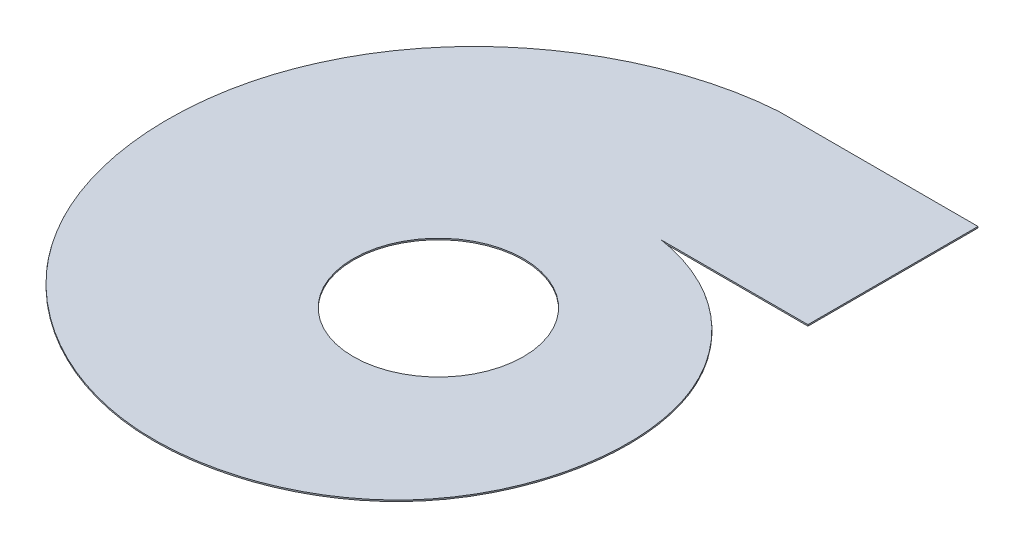
ISO-10303-21;
HEADER;
FILE_DESCRIPTION(('STEP AP214'),'2;1');
FILE_NAME('part.step','',(''),(''),'','','');
FILE_SCHEMA(('AUTOMOTIVE_DESIGN { 1 0 10303 214 1 1 1 1 }'));
ENDSEC;
DATA;
#1=APPLICATION_CONTEXT('core data for automotive mechanical design processes');
#2=APPLICATION_PROTOCOL_DEFINITION('international standard','automotive_design',2000,#1);
#3=PRODUCT_CONTEXT('',#1,'mechanical');
#4=PRODUCT('Part','Part','',(#3));
#5=PRODUCT_RELATED_PRODUCT_CATEGORY('part','',(#4));
#6=PRODUCT_DEFINITION_FORMATION('','',#4);
#7=PRODUCT_DEFINITION_CONTEXT('part definition',#1,'design');
#8=PRODUCT_DEFINITION('design','',#6,#7);
#9=PRODUCT_DEFINITION_SHAPE('','',#8);
#10=(LENGTH_UNIT() NAMED_UNIT(*) SI_UNIT(.MILLI.,.METRE.));
#11=(NAMED_UNIT(*) PLANE_ANGLE_UNIT() SI_UNIT($,.RADIAN.));
#12=(NAMED_UNIT(*) SI_UNIT($,.STERADIAN.) SOLID_ANGLE_UNIT());
#13=UNCERTAINTY_MEASURE_WITH_UNIT(LENGTH_MEASURE(1.E-05),#10,'distance_accuracy_value','');
#14=(GEOMETRIC_REPRESENTATION_CONTEXT(3) GLOBAL_UNCERTAINTY_ASSIGNED_CONTEXT((#13)) GLOBAL_UNIT_ASSIGNED_CONTEXT((#10,
#11,#12)) REPRESENTATION_CONTEXT('',''));
#15=CARTESIAN_POINT('',(0.,0.,0.));
#16=DIRECTION('',(0.,0.,1.));
#17=DIRECTION('',(1.,0.,0.));
#18=AXIS2_PLACEMENT_3D('',#15,#16,#17);
#19=CARTESIAN_POINT('',(-202.088029277198,0.,340.089037520894));
#20=DIRECTION('',(0.,-1.,0.));
#21=DIRECTION('',(0.,0.,-1.));
#22=AXIS2_PLACEMENT_3D('',#19,#20,#21);
#23=PLANE('',#22);
#24=CARTESIAN_POINT('',(0.,0.,0.));
#25=DIRECTION('',(0.,1.,0.));
#26=DIRECTION('',(0.,0.,1.));
#27=AXIS2_PLACEMENT_3D('',#24,#25,#26);
#28=CIRCLE('',#27,125.);
#29=CARTESIAN_POINT('',(0.,0.,125.));
#30=VERTEX_POINT('',#29);
#31=EDGE_CURVE('E185',#30,#30,#28,.T.);
#32=ORIENTED_EDGE('',*,*,#31,.F.);
#33=EDGE_LOOP('',(#32));
#34=FACE_BOUND('',#33,.T.);
#35=CARTESIAN_POINT('',(-1.51614831800373E-12,0.,-500.));
#36=CARTESIAN_POINT('',(-121.735694782618,0.,-491.432273979318));
#37=CARTESIAN_POINT('',(-313.70035987812,0.,-396.44166070075));
#38=CARTESIAN_POINT('',(-452.526897534728,0.,-136.273127559046));
#39=CARTESIAN_POINT('',(-438.495522047138,0.,84.5434590160957));
#40=CARTESIAN_POINT('',(-316.990167099942,0.,288.560325686227));
#41=CARTESIAN_POINT('',(-69.9789110870107,0.,425.752164190326));
#42=CARTESIAN_POINT('',(285.053092388066,0.,296.782675328895));
#43=CARTESIAN_POINT('',(348.131054402755,0.,-49.5077087625764));
#44=CARTESIAN_POINT('',(180.649502040765,0.,-235.122306433307));
#45=CARTESIAN_POINT('',(56.0182707534848,0.,-259.081421156659));
#46=CARTESIAN_POINT('',(0.,0.,-250.));
#47=B_SPLINE_CURVE_WITH_KNOTS('',3,(#35,#36,#37,#38,#39,#40,#41,#42,#43,#44,#45,#46),
.UNSPECIFIED.,.F.,.F.,(4,1,1,1,1,1,1,1,1,4),(0.,0.158819890851184,0.25244839977915,
0.369226367804826,0.42541946423916,0.556944650266808,0.698898778526058,0.846399015982612,
0.926374081741202,1.),.UNSPECIFIED.);
#48=CARTESIAN_POINT('',(-59.0712145920364,0.,376.585920873753));
#49=VERTEX_POINT('',#48);
#50=CARTESIAN_POINT('',(77.7700123232973,0.,-250.000000000145));
#51=VERTEX_POINT('',#50);
#52=EDGE_CURVE('E59',#49,#51,#47,.T.);
#53=ORIENTED_EDGE('',*,*,#52,.T.);
#54=DIRECTION('',(1.,0.,0.));
#55=VECTOR('',#54,1.);
#56=CARTESIAN_POINT('',(0.,0.,-250.));
#57=LINE('',#56,#55);
#58=CARTESIAN_POINT('',(293.259068653268,0.,-250.));
#59=VERTEX_POINT('',#58);
#60=EDGE_CURVE('E187',#51,#59,#57,.T.);
#61=ORIENTED_EDGE('',*,*,#60,.T.);
#62=DIRECTION('',(0.,0.,1.));
#63=VECTOR('',#62,1.);
#64=CARTESIAN_POINT('',(293.259068653268,0.,-500.));
#65=LINE('',#64,#63);
#66=CARTESIAN_POINT('',(293.259068653268,0.,-500.));
#67=VERTEX_POINT('',#66);
#68=EDGE_CURVE('E117',#67,#59,#65,.T.);
#69=ORIENTED_EDGE('',*,*,#68,.F.);
#70=DIRECTION('',(1.,0.,0.));
#71=VECTOR('',#70,1.);
#72=CARTESIAN_POINT('',(-1.51614831800373E-12,0.,-500.));
#73=LINE('',#72,#71);
#74=CARTESIAN_POINT('',(-1.51614831800373E-12,0.,-500.));
#75=VERTEX_POINT('',#74);
#76=EDGE_CURVE('E105',#75,#67,#73,.T.);
#77=ORIENTED_EDGE('',*,*,#76,.F.);
#78=CARTESIAN_POINT('',(-71.8416246862968,0.,375.710516909708));
#79=VERTEX_POINT('',#78);
#80=EDGE_CURVE('E13',#75,#79,#47,.T.);
#81=ORIENTED_EDGE('',*,*,#80,.T.);
#82=CARTESIAN_POINT('',(0.,0.,-250.));
#83=CARTESIAN_POINT('',(8.18123086876726,0.,-251.302083333026));
#84=CARTESIAN_POINT('',(16.4904858589972,0.,-252.202239115932));
#85=CARTESIAN_POINT('',(33.2838432146078,0.,-253.165004897292));
#86=CARTESIAN_POINT('',(41.767918014095,0.,-253.227597369565));
#87=CARTESIAN_POINT('',(58.8255292754711,0.,-252.489812838351));
#88=CARTESIAN_POINT('',(67.3990361988134,0.,-251.68942117223));
#89=CARTESIAN_POINT('',(84.5468495515692,0.,-249.209035812598));
#90=CARTESIAN_POINT('',(93.1211247685697,0.,-247.529030536377));
#91=CARTESIAN_POINT('',(110.179448675384,0.,-243.281971110244));
#92=CARTESIAN_POINT('',(118.66346480226,0.,-240.714908643898));
#93=CARTESIAN_POINT('',(135.448838643004,0.,-234.695772918887));
#94=CARTESIAN_POINT('',(143.750162787134,0.,-231.243694761559));
#95=CARTESIAN_POINT('',(160.077308395461,0.,-223.466249466396));
#96=CARTESIAN_POINT('',(168.103095643203,0.,-219.14088096369));
#97=CARTESIAN_POINT('',(183.786929166319,0.,-209.638354885954));
#98=CARTESIAN_POINT('',(191.444940950985,0.,-204.461199557863));
#99=CARTESIAN_POINT('',(206.302623466448,0.,-193.28636485957));
#100=CARTESIAN_POINT('',(213.50225981272,0.,-187.288691385962));
#101=CARTESIAN_POINT('',(227.355264370716,0.,-174.513728488617));
#102=CARTESIAN_POINT('',(234.008598689343,0.,-167.736448608729));
#103=CARTESIAN_POINT('',(246.684770923066,0.,-153.452592355728));
#104=CARTESIAN_POINT('',(252.707575824426,0.,-145.946029131675));
#105=CARTESIAN_POINT('',(264.043165004688,0.,-130.262996352308));
#106=CARTESIAN_POINT('',(269.355917530424,0.,-122.086543467484));
#107=CARTESIAN_POINT('',(279.197554898152,0.,-105.131744499288));
#108=CARTESIAN_POINT('',(283.726409621811,0.,-96.3534184851331));
#109=CARTESIAN_POINT('',(291.933011092096,0.,-78.2709576757544));
#110=CARTESIAN_POINT('',(295.610729718482,0.,-68.9668461837094));
#111=CARTESIAN_POINT('',(302.055300527236,0.,-49.9163187948688));
#112=CARTESIAN_POINT('',(304.822126933795,0.,-40.1699292330862));
#113=CARTESIAN_POINT('',(309.393446559202,0.,-20.3250245640646));
#114=CARTESIAN_POINT('',(311.19791666681,0.,-10.2265385853717));
#115=CARTESIAN_POINT('',(313.80208333319,0.,10.2265385853717));
#116=CARTESIAN_POINT('',(314.601759745985,0.,20.5810981281708));
#117=CARTESIAN_POINT('',(315.163575101264,0.,41.4453734866293));
#118=CARTESIAN_POINT('',(314.925697135991,0.,51.955055437251));
#119=CARTESIAN_POINT('',(313.389873122328,0.,73.0246821043311));
#120=CARTESIAN_POINT('',(312.091913646437,0.,83.5845910737915));
#121=CARTESIAN_POINT('',(308.424085304918,0.,104.646879333399));
#122=CARTESIAN_POINT('',(306.054206695925,0.,115.149221353839));
#123=CARTESIAN_POINT('',(300.241736514608,0.,135.986781135752));
#124=CARTESIAN_POINT('',(296.799139049597,0.,146.321960485977));
#125=CARTESIAN_POINT('',(288.851700556733,0.,166.714935062538));
#126=CARTESIAN_POINT('',(284.346857615167,0.,176.772691136304));
#127=CARTESIAN_POINT('',(274.296788150606,0.,196.501059173741));
#128=CARTESIAN_POINT('',(268.751563778678,0.,206.171631657383));
#129=CARTESIAN_POINT('',(256.653978741307,0.,225.017553672595));
#130=CARTESIAN_POINT('',(250.101624338251,0.,234.192863818506));
#131=CARTESIAN_POINT('',(236.034287727501,0.,251.943048247245));
#132=CARTESIAN_POINT('',(228.519315892065,0.,260.517883668511));
#133=CARTESIAN_POINT('',(212.58226450297,0.,276.965947185267));
#134=CARTESIAN_POINT('',(204.160199387239,0.,284.839137373345));
#135=CARTESIAN_POINT('',(186.475120704669,0.,299.787933776882));
#136=CARTESIAN_POINT('',(177.212125551479,0.,306.863503462129));
#137=CARTESIAN_POINT('',(157.921492035754,0.,320.12739541053));
#138=CARTESIAN_POINT('',(147.893875927803,0.,326.315682934834));
#139=CARTESIAN_POINT('',(127.159841084605,0.,337.722731057653));
#140=CARTESIAN_POINT('',(116.453448267127,0.,342.941459114445));
#141=CARTESIAN_POINT('',(94.4565125505682,0.,352.335503565987));
#142=CARTESIAN_POINT('',(83.1659990126438,0.,356.510790002129));
#143=CARTESIAN_POINT('',(60.1034562179506,0.,363.753400293993));
#144=CARTESIAN_POINT('',(48.3314595051577,0.,366.820697137299));
#145=CARTESIAN_POINT('',(24.4156368331883,0.,371.792967189722));
#146=CARTESIAN_POINT('',(12.271846302555,0.,373.697916666581));
#147=CARTESIAN_POINT('',(-12.2718463025549,0.,376.302083333419));
#148=CARTESIAN_POINT('',(-24.6717103972528,0.,377.001280376191));
#149=CARTESIAN_POINT('',(-49.6069037587423,0.,377.162145305084));
#150=CARTESIAN_POINT('',(-62.1421928603835,0.,376.623796902581));
#151=CARTESIAN_POINT('',(-87.2238349332148,0.,374.289933406142));
#152=CARTESIAN_POINT('',(-99.7701459485291,0.,372.49440611977));
#153=CARTESIAN_POINT('',(-124.746909115469,0.,367.63913479811));
#154=CARTESIAN_POINT('',(-137.177317939081,0.,364.579382854976));
#155=CARTESIAN_POINT('',(-161.794113596146,0.,357.201501919467));
#156=CARTESIAN_POINT('',(-173.980456169745,0.,352.883369455503));
#157=CARTESIAN_POINT('',(-197.981031482019,0.,343.007628194371));
#158=CARTESIAN_POINT('',(-209.795219485259,0.,337.450020469828));
#159=CARTESIAN_POINT('',(-232.924809952237,0.,325.127326833763));
#160=CARTESIAN_POINT('',(-244.240167672522,0.,318.362246594301));
#161=CARTESIAN_POINT('',(-266.248178177912,0.,303.669602596026));
#162=CARTESIAN_POINT('',(-276.940786686513,0.,295.742049119143));
#163=CARTESIAN_POINT('',(-297.583473027557,0.,278.782210594927));
#164=CARTESIAN_POINT('',(-307.533507523385,0.,269.749940397866));
#165=CARTESIAN_POINT('',(-326.576630000735,0.,250.650800517624));
#166=CARTESIAN_POINT('',(-335.66967605612,0.,240.583950165703));
#167=CARTESIAN_POINT('',(-352.891096631925,0.,219.497649053655));
#168=CARTESIAN_POINT('',(-361.019431100395,0.,208.478221971));
#169=CARTESIAN_POINT('',(-376.211625815808,0.,185.579987719483));
#170=CARTESIAN_POINT('',(-383.27544833862,0.,173.701208388017));
#171=CARTESIAN_POINT('',(-396.247907217778,0.,149.187937670028));
#172=CARTESIAN_POINT('',(-402.156508607812,0.,136.553478048962));
#173=CARTESIAN_POINT('',(-412.737996039147,0.,110.642067425541));
#174=CARTESIAN_POINT('',(-417.410850285412,0.,97.3651518416145));
#175=CARTESIAN_POINT('',(-425.451500061114,0.,70.2905936409961));
#176=CARTESIAN_POINT('',(-428.819267340828,0.,56.4929897772418));
#177=CARTESIAN_POINT('',(-434.192487820218,0.,28.506249102299));
#178=CARTESIAN_POINT('',(-436.197916666667,0.,14.3171540197475));
#179=CARTESIAN_POINT('',(-438.802083333333,0.,-14.3171540197474));
#180=CARTESIAN_POINT('',(-439.400801007106,0.,-28.7623226663634));
#181=CARTESIAN_POINT('',(-439.160715508193,0.,-57.7684340308264));
#182=CARTESIAN_POINT('',(-438.321896668493,0.,-72.3293302831626));
#183=CARTESIAN_POINT('',(-435.189993690634,0.,-101.422987762452));
#184=CARTESIAN_POINT('',(-432.896898593371,0.,-115.955700823236));
#185=CARTESIAN_POINT('',(-426.854184291036,0.,-144.84693889757));
#186=CARTESIAN_POINT('',(-423.104559014809,0.,-159.205414523896));
#187=CARTESIAN_POINT('',(-414.161267323544,0.,-187.601446056967));
#188=CARTESIAN_POINT('',(-408.967599860772,0.,-201.6389518534));
#189=CARTESIAN_POINT('',(-397.163555832647,0.,-229.247127901613));
#190=CARTESIAN_POINT('',(-390.553183323022,0.,-242.817747834191));
#191=CARTESIAN_POINT('',(-375.957865518387,0.,-269.348560730755));
#192=CARTESIAN_POINT('',(-367.972929409144,0.,-282.308703685947));
#193=CARTESIAN_POINT('',(-350.685226451526,0.,-307.478802684943));
#194=CARTESIAN_POINT('',(-341.382473899903,0.,-319.688709554456));
#195=CARTESIAN_POINT('',(-321.530133462485,0.,-343.223897807932));
#196=CARTESIAN_POINT('',(-310.980564904314,0.,-354.549131377893));
#197=CARTESIAN_POINT('',(-288.719336531633,0.,-376.187312816569));
#198=CARTESIAN_POINT('',(-277.007700944567,0.,-386.500214741127));
#199=CARTESIAN_POINT('',(-252.520177402242,0.,-405.994259484737));
#200=CARTESIAN_POINT('',(-239.744318390542,0.,-415.175358738827));
#201=CARTESIAN_POINT('',(-213.238483403191,0.,-432.295856220921));
#202=CARTESIAN_POINT('',(-199.508540848464,0.,-440.235213743901));
#203=CARTESIAN_POINT('',(-171.216034255217,0.,-454.773083376408));
#204=CARTESIAN_POINT('',(-156.653507830614,0.,-461.37155810041));
#205=CARTESIAN_POINT('',(-126.827622300697,0.,-473.140488513076));
#206=CARTESIAN_POINT('',(-111.564304670424,0.,-478.310910570318));
#207=CARTESIAN_POINT('',(-80.4777310642031,0.,-487.149599826612));
#208=CARTESIAN_POINT('',(-64.6545200493005,0.,-490.817837543946));
#209=CARTESIAN_POINT('',(-32.5968613714353,0.,-496.592008451125));
#210=CARTESIAN_POINT('',(-16.3624617374858,0.,-498.697916666211));
#211=CARTESIAN_POINT('',(-1.51614831800373E-12,0.,-500.));
#212=B_SPLINE_CURVE_WITH_KNOTS('',3,(#82,#83,#84,#85,#86,#87,#88,#89,#90,#91,#92,#93,#94,#95,
#96,#97,#98,#99,#100,#101,#102,#103,#104,#105,#106,#107,#108,#109,#110,#111,#112,#113,#114,#115,
#116,#117,#118,#119,#120,#121,#122,#123,#124,#125,#126,#127,#128,#129,#130,#131,#132,#133,#134,
#135,#136,#137,#138,#139,#140,#141,#142,#143,#144,#145,#146,#147,#148,#149,#150,#151,#152,#153,
#154,#155,#156,#157,#158,#159,#160,#161,#162,#163,#164,#165,#166,#167,#168,#169,#170,#171,#172,
#173,#174,#175,#176,#177,#178,#179,#180,#181,#182,#183,#184,#185,#186,#187,#188,#189,#190,#191,
#192,#193,#194,#195,#196,#197,#198,#199,#200,#201,#202,#203,#204,#205,#206,#207,#208,#209,#210,
#211),.UNSPECIFIED.,.F.,.F.,(4,2,2,2,2,2,2,2,2,2,2,2,2,2,2,2,2,2,2,2,2,2,2,2,2,2,2,2,2,2,2,2,2,
2,2,2,2,2,2,2,2,2,2,2,2,2,2,2,2,2,2,2,2,2,2,2,2,2,2,2,2,2,2,2,4),(0.,0.015625,0.03125,0.046875,
0.0625,0.078125,0.09375,0.109375,0.125,0.140625,0.15625,0.171875,0.1875,0.203125,0.21875,
0.234375,0.25,0.265625,0.28125,0.296875,0.3125,0.328125,0.34375,0.359375,0.375,0.390625,0.40625,
0.421875,0.4375,0.453125,0.46875,0.484375,0.5,0.515625,0.53125,0.546875,0.5625,0.578125,0.59375,
0.609375,0.625,0.640625,0.65625,0.671875,0.6875,0.703125,0.71875,0.734375,0.75,0.765625,0.78125,
0.796875,0.8125,0.828125,0.84375,0.859375,0.875,0.890625,0.90625,0.921875,0.9375,0.953125,
0.96875,0.984375,1.),.UNSPECIFIED.);
#213=EDGE_CURVE('E148',#49,#79,#212,.T.);
#214=ORIENTED_EDGE('',*,*,#213,.F.);
#215=EDGE_LOOP('',(#53,#61,#69,#77,#81,#214));
#216=FACE_BOUND('',#215,.T.);
#217=ADVANCED_FACE('F48',(#34,#216),#23,.F.);
#218=CARTESIAN_POINT('',(-1.51614831800373E-12,-2.,-500.));
#219=CARTESIAN_POINT('',(-121.735694782618,-2.,-491.432273979318));
#220=CARTESIAN_POINT('',(-313.70035987812,-2.,-396.44166070075));
#221=CARTESIAN_POINT('',(-452.526897534728,-2.,-136.273127559046));
#222=CARTESIAN_POINT('',(-438.495522047138,-2.,84.5434590160957));
#223=CARTESIAN_POINT('',(-316.990167099942,-2.,288.560325686227));
#224=CARTESIAN_POINT('',(-69.9789110870107,-2.,425.752164190326));
#225=CARTESIAN_POINT('',(285.053092388066,-2.,296.782675328895));
#226=CARTESIAN_POINT('',(348.131054402755,-2.,-49.5077087625764));
#227=CARTESIAN_POINT('',(180.649502040765,-2.,-235.122306433307));
#228=CARTESIAN_POINT('',(56.0182707534848,-2.,-259.081421156659));
#229=CARTESIAN_POINT('',(0.,-2.,-250.));
#230=B_SPLINE_CURVE_WITH_KNOTS('',3,(#218,#219,#220,#221,#222,#223,#224,#225,#226,#227,#228,
#229),.UNSPECIFIED.,.F.,.F.,(4,1,1,1,1,1,1,1,1,4),(0.,0.158819890851184,0.25244839977915,
0.369226367804826,0.42541946423916,0.556944650266808,0.698898778526058,0.846399015982612,
0.926374081741202,1.),.UNSPECIFIED.);
#231=DIRECTION('',(0.,1.,0.));
#232=VECTOR('',#231,1.);
#233=SURFACE_OF_LINEAR_EXTRUSION('',#230,#232);
#234=DIRECTION('',(0.,1.,0.));
#235=VECTOR('',#234,1.);
#236=CARTESIAN_POINT('',(77.7700123242326,-2.,-250.));
#237=LINE('',#236,#235);
#238=CARTESIAN_POINT('',(77.7700123232973,-2.,-250.000000000145));
#239=VERTEX_POINT('',#238);
#240=EDGE_CURVE('E67',#51,#239,#237,.F.);
#241=ORIENTED_EDGE('',*,*,#240,.F.);
#242=ORIENTED_EDGE('',*,*,#52,.F.);
#243=ORIENTED_EDGE('',*,*,#213,.T.);
#244=ORIENTED_EDGE('',*,*,#80,.F.);
#245=DIRECTION('',(0.,1.,0.));
#246=VECTOR('',#245,1.);
#247=CARTESIAN_POINT('',(-1.51614831800373E-12,-2.,-500.));
#248=LINE('',#247,#246);
#249=CARTESIAN_POINT('',(-1.51614831800373E-12,-2.,-500.));
#250=VERTEX_POINT('',#249);
#251=EDGE_CURVE('E128',#250,#75,#248,.T.);
#252=ORIENTED_EDGE('',*,*,#251,.F.);
#253=EDGE_CURVE('E72',#250,#239,#230,.T.);
#254=ORIENTED_EDGE('',*,*,#253,.T.);
#255=EDGE_LOOP('',(#241,#242,#243,#244,#252,#254));
#256=FACE_BOUND('',#255,.T.);
#257=ADVANCED_FACE('F50',(#256),#233,.T.);
#258=CARTESIAN_POINT('',(-202.088029277198,-2.,340.089037520894));
#259=DIRECTION('',(0.,-1.,0.));
#260=DIRECTION('',(0.,0.,-1.));
#261=AXIS2_PLACEMENT_3D('',#258,#259,#260);
#262=PLANE('',#261);
#263=CARTESIAN_POINT('',(0.,-2.,0.));
#264=DIRECTION('',(0.,-1.,0.));
#265=DIRECTION('',(0.,0.,-1.));
#266=AXIS2_PLACEMENT_3D('',#263,#264,#265);
#267=CIRCLE('',#266,125.);
#268=CARTESIAN_POINT('',(0.,-2.,-125.));
#269=VERTEX_POINT('',#268);
#270=EDGE_CURVE('E54',#269,#269,#267,.T.);
#271=ORIENTED_EDGE('',*,*,#270,.F.);
#272=EDGE_LOOP('',(#271));
#273=FACE_BOUND('',#272,.T.);
#274=ORIENTED_EDGE('',*,*,#253,.F.);
#275=DIRECTION('',(1.,0.,0.));
#276=VECTOR('',#275,1.);
#277=CARTESIAN_POINT('',(-1.51614831800373E-12,-2.,-500.));
#278=LINE('',#277,#276);
#279=CARTESIAN_POINT('',(293.259068653268,-2.,-500.));
#280=VERTEX_POINT('',#279);
#281=EDGE_CURVE('E110',#250,#280,#278,.T.);
#282=ORIENTED_EDGE('',*,*,#281,.T.);
#283=DIRECTION('',(0.,0.,1.));
#284=VECTOR('',#283,1.);
#285=CARTESIAN_POINT('',(293.259068653268,-2.,-500.));
#286=LINE('',#285,#284);
#287=CARTESIAN_POINT('',(293.259068653268,-2.,-250.));
#288=VERTEX_POINT('',#287);
#289=EDGE_CURVE('E104',#280,#288,#286,.T.);
#290=ORIENTED_EDGE('',*,*,#289,.T.);
#291=DIRECTION('',(1.,0.,0.));
#292=VECTOR('',#291,1.);
#293=CARTESIAN_POINT('',(0.,-2.,-250.));
#294=LINE('',#293,#292);
#295=EDGE_CURVE('E96',#239,#288,#294,.T.);
#296=ORIENTED_EDGE('',*,*,#295,.F.);
#297=EDGE_LOOP('',(#274,#282,#290,#296));
#298=FACE_BOUND('',#297,.T.);
#299=ADVANCED_FACE('F108',(#273,#298),#262,.T.);
#300=CARTESIAN_POINT('',(-1.51614831800373E-12,-2.,-500.));
#301=DIRECTION('',(0.,0.,1.));
#302=DIRECTION('',(1.,0.,0.));
#303=AXIS2_PLACEMENT_3D('',#300,#301,#302);
#304=PLANE('',#303);
#305=ORIENTED_EDGE('',*,*,#76,.T.);
#306=DIRECTION('',(0.,1.,0.));
#307=VECTOR('',#306,1.);
#308=CARTESIAN_POINT('',(293.259068653268,-2.,-500.));
#309=LINE('',#308,#307);
#310=EDGE_CURVE('E118',#280,#67,#309,.T.);
#311=ORIENTED_EDGE('',*,*,#310,.F.);
#312=ORIENTED_EDGE('',*,*,#281,.F.);
#313=ORIENTED_EDGE('',*,*,#251,.T.);
#314=EDGE_LOOP('',(#305,#311,#312,#313));
#315=FACE_BOUND('',#314,.T.);
#316=ADVANCED_FACE('F166',(#315),#304,.F.);
#317=CARTESIAN_POINT('',(293.259068653268,-2.,-500.));
#318=DIRECTION('',(-1.,0.,0.));
#319=DIRECTION('',(0.,0.,1.));
#320=AXIS2_PLACEMENT_3D('',#317,#318,#319);
#321=PLANE('',#320);
#322=ORIENTED_EDGE('',*,*,#68,.T.);
#323=DIRECTION('',(0.,1.,0.));
#324=VECTOR('',#323,1.);
#325=CARTESIAN_POINT('',(293.259068653268,-2.,-250.));
#326=LINE('',#325,#324);
#327=EDGE_CURVE('E101',#288,#59,#326,.T.);
#328=ORIENTED_EDGE('',*,*,#327,.F.);
#329=ORIENTED_EDGE('',*,*,#289,.F.);
#330=ORIENTED_EDGE('',*,*,#310,.T.);
#331=EDGE_LOOP('',(#322,#328,#329,#330));
#332=FACE_BOUND('',#331,.T.);
#333=ADVANCED_FACE('F115',(#332),#321,.F.);
#334=CARTESIAN_POINT('',(0.,-2.,-250.));
#335=DIRECTION('',(0.,0.,1.));
#336=DIRECTION('',(1.,0.,0.));
#337=AXIS2_PLACEMENT_3D('',#334,#335,#336);
#338=PLANE('',#337);
#339=ORIENTED_EDGE('',*,*,#60,.F.);
#340=ORIENTED_EDGE('',*,*,#240,.T.);
#341=ORIENTED_EDGE('',*,*,#295,.T.);
#342=ORIENTED_EDGE('',*,*,#327,.T.);
#343=EDGE_LOOP('',(#339,#340,#341,#342));
#344=FACE_BOUND('',#343,.T.);
#345=ADVANCED_FACE('F99',(#344),#338,.T.);
#346=CARTESIAN_POINT('',(0.,-10.,0.));
#347=DIRECTION('',(0.,1.,0.));
#348=DIRECTION('',(0.,0.,1.));
#349=AXIS2_PLACEMENT_3D('',#346,#347,#348);
#350=CYLINDRICAL_SURFACE('',#349,125.);
#351=ORIENTED_EDGE('',*,*,#270,.T.);
#352=EDGE_LOOP('',(#351));
#353=FACE_BOUND('',#352,.T.);
#354=ORIENTED_EDGE('',*,*,#31,.T.);
#355=EDGE_LOOP('',(#354));
#356=FACE_BOUND('',#355,.T.);
#357=ADVANCED_FACE('F170',(#353,#356),#350,.F.);
#358=CLOSED_SHELL('',(#217,#257,#299,#316,#333,#345,#357));
#359=MANIFOLD_SOLID_BREP('B2',#358);
#360=ADVANCED_BREP_SHAPE_REPRESENTATION('',(#18,#359),#14);
#361=SHAPE_DEFINITION_REPRESENTATION(#9,#360);
ENDSEC;
END-ISO-10303-21;
